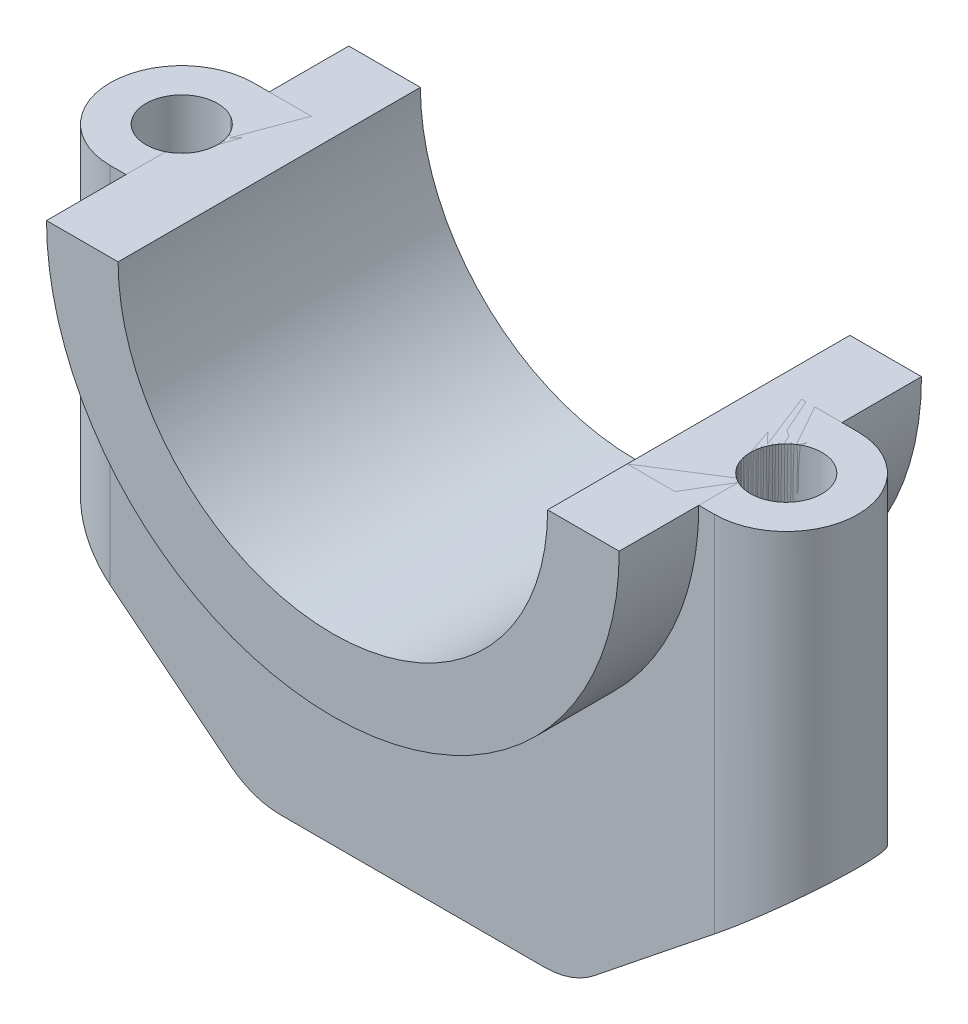
ISO-10303-21;
HEADER;
FILE_DESCRIPTION(('STEP AP214'),'2;1');
FILE_NAME('part.step','',(''),(''),'','','');
FILE_SCHEMA(('AUTOMOTIVE_DESIGN { 1 0 10303 214 1 1 1 1 }'));
ENDSEC;
DATA;
#1=APPLICATION_CONTEXT('core data for automotive mechanical design processes');
#2=APPLICATION_PROTOCOL_DEFINITION('international standard','automotive_design',2000,#1);
#3=PRODUCT_CONTEXT('',#1,'mechanical');
#4=PRODUCT('Part','Part','',(#3));
#5=PRODUCT_RELATED_PRODUCT_CATEGORY('part','',(#4));
#6=PRODUCT_DEFINITION_FORMATION('','',#4);
#7=PRODUCT_DEFINITION_CONTEXT('part definition',#1,'design');
#8=PRODUCT_DEFINITION('design','',#6,#7);
#9=PRODUCT_DEFINITION_SHAPE('','',#8);
#10=(LENGTH_UNIT() NAMED_UNIT(*) SI_UNIT(.MILLI.,.METRE.));
#11=(NAMED_UNIT(*) PLANE_ANGLE_UNIT() SI_UNIT($,.RADIAN.));
#12=(NAMED_UNIT(*) SI_UNIT($,.STERADIAN.) SOLID_ANGLE_UNIT());
#13=UNCERTAINTY_MEASURE_WITH_UNIT(LENGTH_MEASURE(1.E-05),#10,'distance_accuracy_value','');
#14=(GEOMETRIC_REPRESENTATION_CONTEXT(3) GLOBAL_UNCERTAINTY_ASSIGNED_CONTEXT((#13)) GLOBAL_UNIT_ASSIGNED_CONTEXT((#10,
#11,#12)) REPRESENTATION_CONTEXT('',''));
#15=CARTESIAN_POINT('',(0.,0.,0.));
#16=DIRECTION('',(0.,0.,1.));
#17=DIRECTION('',(1.,0.,0.));
#18=AXIS2_PLACEMENT_3D('',#15,#16,#17);
#19=CARTESIAN_POINT('',(0.,0.,19.));
#20=DIRECTION('',(0.,0.,-1.));
#21=DIRECTION('',(-1.,0.,0.));
#22=AXIS2_PLACEMENT_3D('',#19,#20,#21);
#23=CYLINDRICAL_SURFACE('',#22,27.);
#24=CARTESIAN_POINT('',(0.,0.,-19.));
#25=DIRECTION('',(0.,0.,1.));
#26=DIRECTION('',(1.,0.,0.));
#27=AXIS2_PLACEMENT_3D('',#24,#25,#26);
#28=CIRCLE('',#27,27.);
#29=CARTESIAN_POINT('',(-27.,0.,-19.));
#30=VERTEX_POINT('',#29);
#31=CARTESIAN_POINT('',(27.,0.,-19.));
#32=VERTEX_POINT('',#31);
#33=EDGE_CURVE('E132',#30,#32,#28,.T.);
#34=ORIENTED_EDGE('',*,*,#33,.F.);
#35=DIRECTION('',(0.,0.,-1.));
#36=VECTOR('',#35,1.);
#37=CARTESIAN_POINT('',(-27.,0.,19.));
#38=LINE('',#37,#36);
#39=CARTESIAN_POINT('',(-27.,0.,19.));
#40=VERTEX_POINT('',#39);
#41=EDGE_CURVE('E76',#40,#30,#38,.T.);
#42=ORIENTED_EDGE('',*,*,#41,.F.);
#43=CARTESIAN_POINT('',(0.,0.,19.));
#44=DIRECTION('',(0.,0.,1.));
#45=DIRECTION('',(1.,0.,0.));
#46=AXIS2_PLACEMENT_3D('',#43,#44,#45);
#47=CIRCLE('',#46,27.);
#48=CARTESIAN_POINT('',(27.,0.,19.));
#49=VERTEX_POINT('',#48);
#50=EDGE_CURVE('E169',#40,#49,#47,.T.);
#51=ORIENTED_EDGE('',*,*,#50,.T.);
#52=DIRECTION('',(0.,0.,-1.));
#53=VECTOR('',#52,1.);
#54=CARTESIAN_POINT('',(27.,0.,19.));
#55=LINE('',#54,#53);
#56=EDGE_CURVE('E141',#49,#32,#55,.T.);
#57=ORIENTED_EDGE('',*,*,#56,.T.);
#58=EDGE_LOOP('',(#34,#42,#51,#57));
#59=FACE_BOUND('',#58,.T.);
#60=ADVANCED_FACE('F63',(#59),#23,.F.);
#61=CARTESIAN_POINT('',(0.,0.,19.));
#62=DIRECTION('',(0.,1.,0.));
#63=DIRECTION('',(0.,0.,1.));
#64=AXIS2_PLACEMENT_3D('',#61,#62,#63);
#65=PLANE('',#64);
#66=CARTESIAN_POINT('',(-38.,0.,0.));
#67=DIRECTION('',(0.,1.,0.));
#68=DIRECTION('',(0.,0.,1.));
#69=AXIS2_PLACEMENT_3D('',#66,#67,#68);
#70=CIRCLE('',#69,4.5);
#71=CARTESIAN_POINT('',(-36.,0.,4.03112887414927));
#72=VERTEX_POINT('',#71);
#73=CARTESIAN_POINT('',(-36.,0.,-4.03112887414927));
#74=VERTEX_POINT('',#73);
#75=EDGE_CURVE('E82',#72,#74,#70,.T.);
#76=ORIENTED_EDGE('',*,*,#75,.F.);
#77=DIRECTION('',(0.,0.,-1.));
#78=VECTOR('',#77,1.);
#79=CARTESIAN_POINT('',(-36.,0.,19.));
#80=LINE('',#79,#78);
#81=CARTESIAN_POINT('',(-36.,0.,19.));
#82=VERTEX_POINT('',#81);
#83=EDGE_CURVE('E139',#82,#72,#80,.T.);
#84=ORIENTED_EDGE('',*,*,#83,.F.);
#85=DIRECTION('',(1.,0.,0.));
#86=VECTOR('',#85,1.);
#87=CARTESIAN_POINT('',(0.,0.,19.));
#88=LINE('',#87,#86);
#89=EDGE_CURVE('E153',#82,#40,#88,.T.);
#90=ORIENTED_EDGE('',*,*,#89,.T.);
#91=ORIENTED_EDGE('',*,*,#41,.T.);
#92=DIRECTION('',(1.,0.,0.));
#93=VECTOR('',#92,1.);
#94=CARTESIAN_POINT('',(0.,0.,-19.));
#95=LINE('',#94,#93);
#96=CARTESIAN_POINT('',(-36.,0.,-19.));
#97=VERTEX_POINT('',#96);
#98=EDGE_CURVE('E151',#97,#30,#95,.T.);
#99=ORIENTED_EDGE('',*,*,#98,.F.);
#100=EDGE_CURVE('E137',#74,#97,#80,.T.);
#101=ORIENTED_EDGE('',*,*,#100,.F.);
#102=EDGE_LOOP('',(#76,#84,#90,#91,#99,#101));
#103=FACE_BOUND('',#102,.T.);
#104=ADVANCED_FACE('F148',(#103),#65,.T.);
#105=CARTESIAN_POINT('',(0.,0.,19.));
#106=DIRECTION('',(0.,0.,-1.));
#107=DIRECTION('',(-1.,0.,0.));
#108=AXIS2_PLACEMENT_3D('',#105,#106,#107);
#109=CYLINDRICAL_SURFACE('',#108,36.);
#110=ORIENTED_EDGE('',*,*,#83,.T.);
#111=CARTESIAN_POINT('',(-36.,0.,4.03112887414927));
#112=CARTESIAN_POINT('',(-36.0000000557983,-0.188013709173996,4.03112573962688));
#113=CARTESIAN_POINT('',(-35.998527066807,-0.376023509734113,4.03039853185731));
#114=CARTESIAN_POINT('',(-35.9926362603933,-0.751984821952165,4.02746896092898));
#115=CARTESIAN_POINT('',(-35.9882184526503,-0.93993633379966,4.02526660261894));
#116=CARTESIAN_POINT('',(-35.9705481437723,-1.5036785455182,4.01640551216183));
#117=CARTESIAN_POINT('',(-35.9528787575284,-1.87930790342856,4.00749275117653));
#118=CARTESIAN_POINT('',(-35.9056476591523,-2.63203193682279,3.98301390237765));
#119=CARTESIAN_POINT('',(-35.8760099957818,-3.00912044203989,3.9674052821464));
#120=CARTESIAN_POINT('',(-35.8049155027943,-3.76176721539991,3.92851743028222));
#121=CARTESIAN_POINT('',(-35.7634595015463,-4.13732558892192,3.90523873624096));
#122=CARTESIAN_POINT('',(-35.6679059361072,-4.89373675772656,3.84895882859857));
#123=CARTESIAN_POINT('',(-35.6135736760105,-5.27454658530967,3.81577371891469));
#124=CARTESIAN_POINT('',(-35.4929565832223,-6.03303292997784,3.73763305664548));
#125=CARTESIAN_POINT('',(-35.4266728801929,-6.4107097396727,3.69267861632742));
#126=CARTESIAN_POINT('',(-35.2826909967385,-7.16079945510109,3.58806098750926));
#127=CARTESIAN_POINT('',(-35.2050250970399,-7.53322408537032,3.5284390827266));
#128=CARTESIAN_POINT('',(-35.0803706331879,-8.08724048037256,3.42471121552876));
#129=CARTESIAN_POINT('',(-35.0374690192193,-8.27110718345403,3.38776133975927));
#130=CARTESIAN_POINT('',(-34.9490674123995,-8.63701862367302,3.30837604763307));
#131=CARTESIAN_POINT('',(-34.9035676477873,-8.81906351920421,3.26594111270828));
#132=CARTESIAN_POINT('',(-34.8136918206357,-9.16715159673981,3.17821877032383));
#133=CARTESIAN_POINT('',(-34.7694942441547,-9.33335723718422,3.13339498966194));
#134=CARTESIAN_POINT('',(-34.6791924611841,-9.66348236581876,3.0375282894289));
#135=CARTESIAN_POINT('',(-34.6330879829362,-9.82740152367308,2.98648448139151));
#136=CARTESIAN_POINT('',(-34.5392106318234,-10.1524159017312,2.87717425667004));
#137=CARTESIAN_POINT('',(-34.491437160654,-10.3135100774919,2.81890523038839));
#138=CARTESIAN_POINT('',(-34.3945966109139,-10.6319990173295,2.69394199476521));
#139=CARTESIAN_POINT('',(-34.3455297868407,-10.789394497851,2.62724943330277));
#140=CARTESIAN_POINT('',(-34.2560013785844,-11.0699483318514,2.49748812024294));
#141=CARTESIAN_POINT('',(-34.215672934888,-11.1939378496402,2.4361315711842));
#142=CARTESIAN_POINT('',(-34.1349152257627,-11.4378340232424,2.30586152418296));
#143=CARTESIAN_POINT('',(-34.0944859940872,-11.5577418888226,2.23695029139713));
#144=CARTESIAN_POINT('',(-34.0142215539306,-11.7918610278121,2.0905782745039));
#145=CARTESIAN_POINT('',(-33.9743847815826,-11.9060904608359,2.0131476835008));
#146=CARTESIAN_POINT('',(-33.8960206502531,-12.1273875769248,1.84815937166182));
#147=CARTESIAN_POINT('',(-33.8574920366693,-12.2344622231023,1.76061173024656));
#148=CARTESIAN_POINT('',(-33.7858661174036,-12.4308204763775,1.58103453949844));
#149=CARTESIAN_POINT('',(-33.7525799157078,-12.520840920081,1.48989744849442));
#150=CARTESIAN_POINT('',(-33.689520557428,-12.6895355896852,1.29620299503959));
#151=CARTESIAN_POINT('',(-33.6597508888542,-12.7681985671441,1.19363448660173));
#152=CARTESIAN_POINT('',(-33.6053919383276,-12.9105973868877,0.974837963885846));
#153=CARTESIAN_POINT('',(-33.5808848899324,-12.9740978014423,0.858431936470456));
#154=CARTESIAN_POINT('',(-33.5404603906837,-13.0782534767936,0.614487478716559));
#155=CARTESIAN_POINT('',(-33.5245122572628,-13.1189903637506,0.486990744114766));
#156=CARTESIAN_POINT('',(-33.5068054835566,-13.1641320726042,0.264149086378415));
#157=CARTESIAN_POINT('',(-33.5022430620037,-13.1757245630217,0.170467144910296));
#158=CARTESIAN_POINT('',(-33.4990542647936,-13.1838307595428,-0.0176593753999057));
#159=CARTESIAN_POINT('',(-33.5004261295076,-13.1803489354675,-0.112103719885269));
#160=CARTESIAN_POINT('',(-33.5089570974596,-13.158644203925,-0.298761240777823));
#161=CARTESIAN_POINT('',(-33.5161036470163,-13.1404532727653,-0.390978810605043));
#162=CARTESIAN_POINT('',(-33.5354798718711,-13.0909238861703,-0.571228296467531));
#163=CARTESIAN_POINT('',(-33.5477132551728,-13.0595758398128,-0.65925710687025));
#164=CARTESIAN_POINT('',(-33.5824563114603,-12.9700342731434,-0.866351144504587));
#165=CARTESIAN_POINT('',(-33.6071231867094,-12.90609335159,-0.98255470282175));
#166=CARTESIAN_POINT('',(-33.6622085837359,-12.7617270292287,-1.20272163548294));
#167=CARTESIAN_POINT('',(-33.6926414671224,-12.681260424353,-1.306653371682));
#168=CARTESIAN_POINT('',(-33.7516657720454,-12.523216396795,-1.48627197760219));
#169=CARTESIAN_POINT('',(-33.7797014077731,-12.4474425737575,-1.56376562403687));
#170=CARTESIAN_POINT('',(-33.8374249238169,-12.2896596547854,-1.71150979509827));
#171=CARTESIAN_POINT('',(-33.8671139705217,-12.2076461417764,-1.78175510416659));
#172=CARTESIAN_POINT('',(-33.9275301535736,-12.0387191138661,-1.91582991347458));
#173=CARTESIAN_POINT('',(-33.9582587980577,-11.9517983461663,-1.97964950754375));
#174=CARTESIAN_POINT('',(-34.0202595639702,-11.7741587751848,-2.10150625088933));
#175=CARTESIAN_POINT('',(-34.0515318958687,-11.683438480995,-2.15954109950156));
#176=CARTESIAN_POINT('',(-34.1476831349331,-11.4007053542252,-2.32960776067819));
#177=CARTESIAN_POINT('',(-34.2128665666951,-11.203759487929,-2.43328671306787));
#178=CARTESIAN_POINT('',(-34.3420476509585,-10.801324855886,-2.62346101345312));
#179=CARTESIAN_POINT('',(-34.406043950547,-10.59582711653,-2.70993773155297));
#180=CARTESIAN_POINT('',(-34.5318506505607,-10.1783560983058,-2.86919009845059));
#181=CARTESIAN_POINT('',(-34.5936551895309,-9.9663679220593,-2.94193097253875));
#182=CARTESIAN_POINT('',(-34.7141798637052,-9.53809311165747,-3.07595307040701));
#183=CARTESIAN_POINT('',(-34.7729012303722,-9.32180824197945,-3.1372388949237));
#184=CARTESIAN_POINT('',(-34.8978759175449,-8.8436730071932,-3.26129088428467));
#185=CARTESIAN_POINT('',(-34.9633856808066,-8.58110976162614,-3.32204540581356));
#186=CARTESIAN_POINT('',(-35.088935455899,-8.05235961141288,-3.4325912347897));
#187=CARTESIAN_POINT('',(-35.1489740909923,-7.78617181395882,-3.48237978723712));
#188=CARTESIAN_POINT('',(-35.2633131643589,-7.2507761328024,-3.5729349668631));
#189=CARTESIAN_POINT('',(-35.3176078369017,-6.98156550901381,-3.61369257294048));
#190=CARTESIAN_POINT('',(-35.4201877875644,-6.44096294850382,-3.68762272726887));
#191=CARTESIAN_POINT('',(-35.4684727101274,-6.16957088373137,-3.72079482683313));
#192=CARTESIAN_POINT('',(-35.558922379363,-5.62488318762118,-3.78075170717563));
#193=CARTESIAN_POINT('',(-35.6010829517019,-5.35158638975997,-3.80753213933846));
#194=CARTESIAN_POINT('',(-35.6791510262961,-4.80362134037004,-3.85561399641244));
#195=CARTESIAN_POINT('',(-35.7150584004744,-4.52895306086937,-3.87691530910547));
#196=CARTESIAN_POINT('',(-35.7805324817709,-3.97871903159085,-3.91476605629906));
#197=CARTESIAN_POINT('',(-35.8101032859227,-3.70315397937703,-3.93131856359336));
#198=CARTESIAN_POINT('',(-35.862889330305,-3.15119715220291,-3.96025967531034));
#199=CARTESIAN_POINT('',(-35.8861043657098,-2.87480535088927,-3.97264814554256));
#200=CARTESIAN_POINT('',(-35.9374456316318,-2.16524881672561,-3.99964481314717));
#201=CARTESIAN_POINT('',(-35.9609504276453,-1.73163238059938,-4.01156049079648));
#202=CARTESIAN_POINT('',(-35.9844009415626,-1.08152611724865,-4.02335927382502));
#203=CARTESIAN_POINT('',(-35.9902500195788,-0.865278521847778,-4.02627992121258));
#204=CARTESIAN_POINT('',(-35.9980495703292,-0.432689949794082,-4.03016221036749));
#205=CARTESIAN_POINT('',(-35.999999945061,-0.216348970930584,-4.03112380288979));
#206=CARTESIAN_POINT('',(-36.,0.,-4.03112887414927));
#207=B_SPLINE_CURVE_WITH_KNOTS('',3,(#111,#112,#113,#114,#115,#116,#117,#118,#119,#120,#121,
#122,#123,#124,#125,#126,#127,#128,#129,#130,#131,#132,#133,#134,#135,#136,#137,#138,#139,#140,
#141,#142,#143,#144,#145,#146,#147,#148,#149,#150,#151,#152,#153,#154,#155,#156,#157,#158,#159,
#160,#161,#162,#163,#164,#165,#166,#167,#168,#169,#170,#171,#172,#173,#174,#175,#176,#177,#178,
#179,#180,#181,#182,#183,#184,#185,#186,#187,#188,#189,#190,#191,#192,#193,#194,#195,#196,#197,
#198,#199,#200,#201,#202,#203,#204,#205,#206),.UNSPECIFIED.,.F.,.F.,(4,2,2,2,2,2,2,2,2,2,2,2,2,
2,2,2,2,2,2,2,2,2,2,2,2,2,2,2,2,2,2,2,2,2,2,2,2,2,2,2,2,2,2,2,2,2,2,4),(0.,0.564026052510787,
1.1280502511096,2.25624562083412,3.3917159962576,4.5271068040498,5.68504497853642,
6.84287376089532,7.99748022099052,8.57455885997268,9.15158688224185,9.68465326477401,
10.2177958797481,10.7511316186465,11.2843631832909,11.7164497043608,12.1484070233893,
12.5788799803677,13.0089277040587,13.4051898369042,13.8018417747931,14.2043014950865,
14.6053086468198,14.8875329171065,15.1696735082594,15.4512023942618,15.7329368590739,
16.1353793484306,16.5388377167425,16.8742168606217,17.2098356687717,17.5459642047156,
17.8822258941274,18.5767755114326,19.272073274131,19.9691083739157,20.665862916351,
21.4975462624284,22.3294383160507,23.1621576456521,23.9949262183131,24.8282597659886,
25.6616103798505,26.4944205377859,27.3272575313327,28.6300782864645,29.27908180876,
29.9281016449502),.UNSPECIFIED.);
#208=EDGE_CURVE('E12',#72,#74,#207,.T.);
#209=ORIENTED_EDGE('',*,*,#208,.T.);
#210=ORIENTED_EDGE('',*,*,#100,.T.);
#211=CARTESIAN_POINT('',(0.,0.,-19.));
#212=DIRECTION('',(0.,0.,1.));
#213=DIRECTION('',(1.,0.,0.));
#214=AXIS2_PLACEMENT_3D('',#211,#212,#213);
#215=CIRCLE('',#214,36.);
#216=CARTESIAN_POINT('',(36.,0.,-19.));
#217=VERTEX_POINT('',#216);
#218=EDGE_CURVE('E164',#97,#217,#215,.T.);
#219=ORIENTED_EDGE('',*,*,#218,.T.);
#220=DIRECTION('',(0.,0.,-1.));
#221=VECTOR('',#220,1.);
#222=CARTESIAN_POINT('',(36.,0.,19.));
#223=LINE('',#222,#221);
#224=CARTESIAN_POINT('',(36.,0.,-4.03112887414927));
#225=VERTEX_POINT('',#224);
#226=EDGE_CURVE('E131',#225,#217,#223,.T.);
#227=ORIENTED_EDGE('',*,*,#226,.F.);
#228=CARTESIAN_POINT('',(36.,0.,-4.03112887414927));
#229=CARTESIAN_POINT('',(36.0000000557983,-0.188013709173991,-4.03112573962688));
#230=CARTESIAN_POINT('',(35.998527066807,-0.376023509734108,-4.03039853185731));
#231=CARTESIAN_POINT('',(35.9926362603933,-0.751984821952161,-4.02746896092898));
#232=CARTESIAN_POINT('',(35.9882184526503,-0.939936333799656,-4.02526660261894));
#233=CARTESIAN_POINT('',(35.9705481437723,-1.5036785455182,-4.01640551216183));
#234=CARTESIAN_POINT('',(35.9528787575284,-1.87930790342856,-4.00749275117653));
#235=CARTESIAN_POINT('',(35.9056476591523,-2.63203193682279,-3.98301390237765));
#236=CARTESIAN_POINT('',(35.8760099957818,-3.00912044203989,-3.9674052821464));
#237=CARTESIAN_POINT('',(35.8049155027943,-3.76176721539991,-3.92851743028222));
#238=CARTESIAN_POINT('',(35.7634595015463,-4.13732558892192,-3.90523873624095));
#239=CARTESIAN_POINT('',(35.6679059361072,-4.89373675772656,-3.84895882859857));
#240=CARTESIAN_POINT('',(35.6135736760105,-5.27454658530966,-3.8157737189147));
#241=CARTESIAN_POINT('',(35.4929565832223,-6.03303292997784,-3.73763305664548));
#242=CARTESIAN_POINT('',(35.4266728801929,-6.41070973967269,-3.69267861632742));
#243=CARTESIAN_POINT('',(35.2826909967385,-7.16079945510109,-3.58806098750925));
#244=CARTESIAN_POINT('',(35.2050250970399,-7.53322408537031,-3.5284390827266));
#245=CARTESIAN_POINT('',(35.0803706331879,-8.08724048037255,-3.42471121552876));
#246=CARTESIAN_POINT('',(35.0374690192193,-8.27110718345403,-3.38776133975927));
#247=CARTESIAN_POINT('',(34.9490674123995,-8.63701862367301,-3.30837604763307));
#248=CARTESIAN_POINT('',(34.9035676477873,-8.8190635192042,-3.26594111270828));
#249=CARTESIAN_POINT('',(34.8136918206357,-9.16715159673981,-3.17821877032383));
#250=CARTESIAN_POINT('',(34.7694942441547,-9.33335723718421,-3.13339498966193));
#251=CARTESIAN_POINT('',(34.6791924611841,-9.66348236581875,-3.0375282894289));
#252=CARTESIAN_POINT('',(34.6330879829362,-9.82740152367309,-2.98648448139151));
#253=CARTESIAN_POINT('',(34.5392106318234,-10.1524159017312,-2.87717425667004));
#254=CARTESIAN_POINT('',(34.491437160654,-10.3135100774919,-2.81890523038838));
#255=CARTESIAN_POINT('',(34.3945966109139,-10.6319990173295,-2.69394199476519));
#256=CARTESIAN_POINT('',(34.3455297868407,-10.789394497851,-2.62724943330276));
#257=CARTESIAN_POINT('',(34.2560013785844,-11.0699483318514,-2.49748812024294));
#258=CARTESIAN_POINT('',(34.215672934888,-11.1939378496402,-2.43613157118418));
#259=CARTESIAN_POINT('',(34.1349152257627,-11.4378340232424,-2.30586152418295));
#260=CARTESIAN_POINT('',(34.0944859940872,-11.5577418888226,-2.23695029139713));
#261=CARTESIAN_POINT('',(34.0142215539307,-11.7918610278121,-2.09057827450391));
#262=CARTESIAN_POINT('',(33.9743847815826,-11.9060904608359,-2.01314768350081));
#263=CARTESIAN_POINT('',(33.8960206502531,-12.1273875769248,-1.84815937166183));
#264=CARTESIAN_POINT('',(33.8574920366693,-12.2344622231023,-1.76061173024657));
#265=CARTESIAN_POINT('',(33.7858661174036,-12.4308204763774,-1.58103453949845));
#266=CARTESIAN_POINT('',(33.7525799157078,-12.520840920081,-1.48989744849444));
#267=CARTESIAN_POINT('',(33.689520557428,-12.6895355896852,-1.2962029950396));
#268=CARTESIAN_POINT('',(33.6597508888542,-12.7681985671441,-1.19363448660173));
#269=CARTESIAN_POINT('',(33.6053919383276,-12.9105973868877,-0.974837963885843));
#270=CARTESIAN_POINT('',(33.5808848899324,-12.9740978014423,-0.858431936470453));
#271=CARTESIAN_POINT('',(33.5404603906837,-13.0782534767936,-0.61448747871655));
#272=CARTESIAN_POINT('',(33.5245122572628,-13.1189903637506,-0.486990744114752));
#273=CARTESIAN_POINT('',(33.5068054835566,-13.1641320726042,-0.264149086378396));
#274=CARTESIAN_POINT('',(33.5022430620037,-13.1757245630217,-0.170467144910278));
#275=CARTESIAN_POINT('',(33.4990542647936,-13.1838307595428,0.0176593753999224));
#276=CARTESIAN_POINT('',(33.5004261295076,-13.1803489354675,0.112103719885284));
#277=CARTESIAN_POINT('',(33.5089570974596,-13.158644203925,0.298761240777837));
#278=CARTESIAN_POINT('',(33.5161036470163,-13.1404532727654,0.390978810605056));
#279=CARTESIAN_POINT('',(33.5354798718711,-13.0909238861703,0.571228296467544));
#280=CARTESIAN_POINT('',(33.5477132551728,-13.0595758398128,0.659257106870264));
#281=CARTESIAN_POINT('',(33.5824563114603,-12.9700342731434,0.8663511445046));
#282=CARTESIAN_POINT('',(33.6071231867094,-12.90609335159,0.982554702821761));
#283=CARTESIAN_POINT('',(33.6622085837359,-12.7617270292287,1.20272163548295));
#284=CARTESIAN_POINT('',(33.6926414671224,-12.681260424353,1.30665337168201));
#285=CARTESIAN_POINT('',(33.7516657720454,-12.523216396795,1.48627197760221));
#286=CARTESIAN_POINT('',(33.7797014077732,-12.4474425737574,1.56376562403689));
#287=CARTESIAN_POINT('',(33.8374249238169,-12.2896596547854,1.7115097950983));
#288=CARTESIAN_POINT('',(33.8671139705217,-12.2076461417763,1.78175510416661));
#289=CARTESIAN_POINT('',(33.9275301535736,-12.0387191138661,1.91582991347461));
#290=CARTESIAN_POINT('',(33.9582587980577,-11.9517983461662,1.97964950754377));
#291=CARTESIAN_POINT('',(34.0202595639702,-11.7741587751848,2.10150625088935));
#292=CARTESIAN_POINT('',(34.0515318958687,-11.6834384809949,2.15954109950158));
#293=CARTESIAN_POINT('',(34.1476831349331,-11.4007053542251,2.32960776067821));
#294=CARTESIAN_POINT('',(34.2128665666951,-11.203759487929,2.4332867130679));
#295=CARTESIAN_POINT('',(34.3420476509585,-10.8013248558859,2.62346101345315));
#296=CARTESIAN_POINT('',(34.4060439505471,-10.5958271165299,2.709937731553));
#297=CARTESIAN_POINT('',(34.5318506505607,-10.1783560983057,2.86919009845061));
#298=CARTESIAN_POINT('',(34.593655189531,-9.96636792205922,2.94193097253877));
#299=CARTESIAN_POINT('',(34.7141798637052,-9.53809311165738,3.07595307040704));
#300=CARTESIAN_POINT('',(34.7729012303722,-9.32180824197936,3.13723889492372));
#301=CARTESIAN_POINT('',(34.8978759175449,-8.8436730071931,3.26129088428469));
#302=CARTESIAN_POINT('',(34.9633856808066,-8.58110976162604,3.32204540581358));
#303=CARTESIAN_POINT('',(35.088935455899,-8.05235961141276,3.43259123478972));
#304=CARTESIAN_POINT('',(35.1489740909923,-7.78617181395869,3.48237978723714));
#305=CARTESIAN_POINT('',(35.2633131643589,-7.25077613280226,3.57293496686312));
#306=CARTESIAN_POINT('',(35.3176078369018,-6.98156550901367,3.6136925729405));
#307=CARTESIAN_POINT('',(35.4201877875644,-6.44096294850367,3.68762272726889));
#308=CARTESIAN_POINT('',(35.4684727101274,-6.16957088373122,3.72079482683315));
#309=CARTESIAN_POINT('',(35.558922379363,-5.62488318762101,3.78075170717565));
#310=CARTESIAN_POINT('',(35.6010829517019,-5.35158638975979,3.80753213933848));
#311=CARTESIAN_POINT('',(35.6791510262961,-4.80362134036985,3.85561399641245));
#312=CARTESIAN_POINT('',(35.7150584004744,-4.52895306086918,3.87691530910548));
#313=CARTESIAN_POINT('',(35.780532481771,-3.97871903159065,3.91476605629908));
#314=CARTESIAN_POINT('',(35.8101032859227,-3.70315397937682,3.93131856359337));
#315=CARTESIAN_POINT('',(35.862889330305,-3.15119715220269,3.96025967531035));
#316=CARTESIAN_POINT('',(35.8861043657098,-2.87480535088904,3.97264814554257));
#317=CARTESIAN_POINT('',(35.9374456316318,-2.16524881672541,3.99964481314718));
#318=CARTESIAN_POINT('',(35.9609504276453,-1.73163238059922,4.01156049079648));
#319=CARTESIAN_POINT('',(35.9844009415626,-1.08152611724855,4.02335927382502));
#320=CARTESIAN_POINT('',(35.9902500195788,-0.865278521847701,4.02627992121258));
#321=CARTESIAN_POINT('',(35.9980495703292,-0.432689949794043,4.03016221036749));
#322=CARTESIAN_POINT('',(35.999999945061,-0.216348970930565,4.03112380288979));
#323=CARTESIAN_POINT('',(36.,0.,4.03112887414927));
#324=B_SPLINE_CURVE_WITH_KNOTS('',3,(#228,#229,#230,#231,#232,#233,#234,#235,#236,#237,#238,
#239,#240,#241,#242,#243,#244,#245,#246,#247,#248,#249,#250,#251,#252,#253,#254,#255,#256,#257,
#258,#259,#260,#261,#262,#263,#264,#265,#266,#267,#268,#269,#270,#271,#272,#273,#274,#275,#276,
#277,#278,#279,#280,#281,#282,#283,#284,#285,#286,#287,#288,#289,#290,#291,#292,#293,#294,#295,
#296,#297,#298,#299,#300,#301,#302,#303,#304,#305,#306,#307,#308,#309,#310,#311,#312,#313,#314,
#315,#316,#317,#318,#319,#320,#321,#322,#323),.UNSPECIFIED.,.F.,.F.,(4,2,2,2,2,2,2,2,2,2,2,2,2,
2,2,2,2,2,2,2,2,2,2,2,2,2,2,2,2,2,2,2,2,2,2,2,2,2,2,2,2,2,2,2,2,2,2,4),(0.,0.564026052510787,
1.1280502511096,2.25624562083413,3.39171599625761,4.5271068040498,5.68504497853642,
6.84287376089532,7.99748022099052,8.57455885997268,9.15158688224185,9.68465326477401,
10.2177958797481,10.7511316186466,11.2843631832909,11.7164497043608,12.1484070233893,
12.5788799803677,13.0089277040586,13.4051898369042,13.8018417747931,14.2043014950865,
14.6053086468198,14.8875329171065,15.1696735082594,15.4512023942619,15.7329368590739,
16.1353793484306,16.5388377167425,16.8742168606217,17.2098356687717,17.5459642047156,
17.8822258941275,18.5767755114326,19.2720732741311,19.9691083739158,20.6658629163511,
21.4975462624285,22.3294383160509,23.1621576456523,23.9949262183132,24.8282597659888,
25.6616103798507,26.4944205377861,27.3272575313329,28.6300782864647,29.27908180876,
29.9281016449502),.UNSPECIFIED.);
#325=CARTESIAN_POINT('',(36.,0.,4.03112887414927));
#326=VERTEX_POINT('',#325);
#327=EDGE_CURVE('E88',#225,#326,#324,.T.);
#328=ORIENTED_EDGE('',*,*,#327,.T.);
#329=CARTESIAN_POINT('',(36.,0.,19.));
#330=VERTEX_POINT('',#329);
#331=EDGE_CURVE('E128',#330,#326,#223,.T.);
#332=ORIENTED_EDGE('',*,*,#331,.F.);
#333=CARTESIAN_POINT('',(0.,0.,19.));
#334=DIRECTION('',(0.,0.,1.));
#335=DIRECTION('',(1.,0.,0.));
#336=AXIS2_PLACEMENT_3D('',#333,#334,#335);
#337=CIRCLE('',#336,36.);
#338=EDGE_CURVE('E171',#82,#330,#337,.T.);
#339=ORIENTED_EDGE('',*,*,#338,.F.);
#340=EDGE_LOOP('',(#110,#209,#210,#219,#227,#328,#332,#339));
#341=FACE_BOUND('',#340,.T.);
#342=ADVANCED_FACE('F126',(#341),#109,.T.);
#343=CARTESIAN_POINT('',(0.,0.,19.));
#344=DIRECTION('',(0.,1.,0.));
#345=DIRECTION('',(0.,0.,1.));
#346=AXIS2_PLACEMENT_3D('',#343,#344,#345);
#347=PLANE('',#346);
#348=CARTESIAN_POINT('',(38.,0.,0.));
#349=DIRECTION('',(0.,1.,0.));
#350=DIRECTION('',(0.,0.,1.));
#351=AXIS2_PLACEMENT_3D('',#348,#349,#350);
#352=CIRCLE('',#351,4.5);
#353=EDGE_CURVE('E117',#225,#326,#352,.T.);
#354=ORIENTED_EDGE('',*,*,#353,.F.);
#355=ORIENTED_EDGE('',*,*,#226,.T.);
#356=DIRECTION('',(1.,0.,0.));
#357=VECTOR('',#356,1.);
#358=CARTESIAN_POINT('',(0.,0.,-19.));
#359=LINE('',#358,#357);
#360=EDGE_CURVE('E166',#32,#217,#359,.T.);
#361=ORIENTED_EDGE('',*,*,#360,.F.);
#362=ORIENTED_EDGE('',*,*,#56,.F.);
#363=DIRECTION('',(1.,0.,0.));
#364=VECTOR('',#363,1.);
#365=CARTESIAN_POINT('',(0.,0.,19.));
#366=LINE('',#365,#364);
#367=EDGE_CURVE('E136',#49,#330,#366,.T.);
#368=ORIENTED_EDGE('',*,*,#367,.T.);
#369=ORIENTED_EDGE('',*,*,#331,.T.);
#370=EDGE_LOOP('',(#354,#355,#361,#362,#368,#369));
#371=FACE_BOUND('',#370,.T.);
#372=ADVANCED_FACE('F134',(#371),#347,.T.);
#373=CARTESIAN_POINT('',(0.,0.,19.));
#374=DIRECTION('',(0.,0.,1.));
#375=DIRECTION('',(1.,0.,0.));
#376=AXIS2_PLACEMENT_3D('',#373,#374,#375);
#377=PLANE('',#376);
#378=ORIENTED_EDGE('',*,*,#50,.F.);
#379=ORIENTED_EDGE('',*,*,#89,.F.);
#380=ORIENTED_EDGE('',*,*,#338,.T.);
#381=ORIENTED_EDGE('',*,*,#367,.F.);
#382=EDGE_LOOP('',(#378,#379,#380,#381));
#383=FACE_BOUND('',#382,.T.);
#384=ADVANCED_FACE('F180',(#383),#377,.T.);
#385=CARTESIAN_POINT('',(0.,0.,-19.));
#386=DIRECTION('',(0.,0.,1.));
#387=DIRECTION('',(1.,0.,0.));
#388=AXIS2_PLACEMENT_3D('',#385,#386,#387);
#389=PLANE('',#388);
#390=ORIENTED_EDGE('',*,*,#33,.T.);
#391=ORIENTED_EDGE('',*,*,#360,.T.);
#392=ORIENTED_EDGE('',*,*,#218,.F.);
#393=ORIENTED_EDGE('',*,*,#98,.T.);
#394=EDGE_LOOP('',(#390,#391,#392,#393));
#395=FACE_BOUND('',#394,.T.);
#396=ADVANCED_FACE('F163',(#395),#389,.F.);
#397=CARTESIAN_POINT('',(38.,-60.,0.));
#398=DIRECTION('',(0.,1.,0.));
#399=DIRECTION('',(0.,0.,1.));
#400=AXIS2_PLACEMENT_3D('',#397,#398,#399);
#401=CYLINDRICAL_SURFACE('',#400,4.5);
#402=ORIENTED_EDGE('',*,*,#353,.T.);
#403=ORIENTED_EDGE('',*,*,#327,.F.);
#404=EDGE_LOOP('',(#402,#403));
#405=FACE_BOUND('',#404,.T.);
#406=ADVANCED_FACE('F118',(#405),#401,.F.);
#407=CARTESIAN_POINT('',(-38.,-60.,0.));
#408=DIRECTION('',(0.,1.,0.));
#409=DIRECTION('',(0.,0.,1.));
#410=AXIS2_PLACEMENT_3D('',#407,#408,#409);
#411=CYLINDRICAL_SURFACE('',#410,4.5);
#412=ORIENTED_EDGE('',*,*,#75,.T.);
#413=ORIENTED_EDGE('',*,*,#208,.F.);
#414=EDGE_LOOP('',(#412,#413));
#415=FACE_BOUND('',#414,.T.);
#416=ADVANCED_FACE('F182',(#415),#411,.F.);
#417=CLOSED_SHELL('',(#60,#104,#342,#372,#384,#396,#406,#416));
#418=MANIFOLD_SOLID_BREP('B2',#417);
#419=CARTESIAN_POINT('',(0.,0.,9.));
#420=DIRECTION('',(0.,1.,0.));
#421=DIRECTION('',(0.,0.,1.));
#422=AXIS2_PLACEMENT_3D('',#419,#420,#421);
#423=PLANE('',#422);
#424=CARTESIAN_POINT('',(38.,0.,0.));
#425=DIRECTION('',(0.,1.,0.));
#426=DIRECTION('',(0.,0.,1.));
#427=AXIS2_PLACEMENT_3D('',#424,#425,#426);
#428=CIRCLE('',#427,4.5);
#429=CARTESIAN_POINT('',(38.,0.,4.5));
#430=VERTEX_POINT('',#429);
#431=EDGE_CURVE('E456',#430,#430,#428,.T.);
#432=ORIENTED_EDGE('',*,*,#431,.F.);
#433=EDGE_LOOP('',(#432));
#434=FACE_BOUND('',#433,.T.);
#435=DIRECTION('',(1.,0.,0.));
#436=VECTOR('',#435,1.);
#437=CARTESIAN_POINT('',(0.,0.,9.));
#438=LINE('',#437,#436);
#439=CARTESIAN_POINT('',(27.,0.,9.));
#440=VERTEX_POINT('',#439);
#441=CARTESIAN_POINT('',(38.,0.,9.));
#442=VERTEX_POINT('',#441);
#443=EDGE_CURVE('E364',#440,#442,#438,.T.);
#444=ORIENTED_EDGE('',*,*,#443,.T.);
#445=CARTESIAN_POINT('',(38.,0.,0.));
#446=DIRECTION('',(0.,1.,0.));
#447=DIRECTION('',(0.,0.,1.));
#448=AXIS2_PLACEMENT_3D('',#445,#446,#447);
#449=CIRCLE('',#448,9.);
#450=CARTESIAN_POINT('',(38.,0.,-9.));
#451=VERTEX_POINT('',#450);
#452=EDGE_CURVE('E350',#442,#451,#449,.T.);
#453=ORIENTED_EDGE('',*,*,#452,.T.);
#454=DIRECTION('',(1.,0.,0.));
#455=VECTOR('',#454,1.);
#456=CARTESIAN_POINT('',(0.,0.,-9.));
#457=LINE('',#456,#455);
#458=CARTESIAN_POINT('',(27.,0.,-9.));
#459=VERTEX_POINT('',#458);
#460=EDGE_CURVE('E374',#459,#451,#457,.T.);
#461=ORIENTED_EDGE('',*,*,#460,.F.);
#462=DIRECTION('',(0.,0.,-1.));
#463=VECTOR('',#462,1.);
#464=CARTESIAN_POINT('',(27.,0.,9.));
#465=LINE('',#464,#463);
#466=EDGE_CURVE('E396',#440,#459,#465,.T.);
#467=ORIENTED_EDGE('',*,*,#466,.F.);
#468=EDGE_LOOP('',(#444,#453,#461,#467));
#469=FACE_BOUND('',#468,.T.);
#470=ADVANCED_FACE('F249',(#434,#469),#423,.T.);
#471=CARTESIAN_POINT('',(0.,0.,9.));
#472=DIRECTION('',(0.,1.,0.));
#473=DIRECTION('',(0.,0.,1.));
#474=AXIS2_PLACEMENT_3D('',#471,#472,#473);
#475=PLANE('',#474);
#476=CARTESIAN_POINT('',(-38.,0.,0.));
#477=DIRECTION('',(0.,1.,0.));
#478=DIRECTION('',(0.,0.,1.));
#479=AXIS2_PLACEMENT_3D('',#476,#477,#478);
#480=CIRCLE('',#479,4.5);
#481=CARTESIAN_POINT('',(-38.,0.,4.5));
#482=VERTEX_POINT('',#481);
#483=EDGE_CURVE('E404',#482,#482,#480,.T.);
#484=ORIENTED_EDGE('',*,*,#483,.F.);
#485=EDGE_LOOP('',(#484));
#486=FACE_BOUND('',#485,.T.);
#487=DIRECTION('',(1.,0.,0.));
#488=VECTOR('',#487,1.);
#489=CARTESIAN_POINT('',(0.,0.,-9.));
#490=LINE('',#489,#488);
#491=CARTESIAN_POINT('',(-38.,0.,-9.));
#492=VERTEX_POINT('',#491);
#493=CARTESIAN_POINT('',(-27.,0.,-9.));
#494=VERTEX_POINT('',#493);
#495=EDGE_CURVE('E347',#492,#494,#490,.T.);
#496=ORIENTED_EDGE('',*,*,#495,.F.);
#497=CARTESIAN_POINT('',(-38.,0.,0.));
#498=DIRECTION('',(0.,1.,0.));
#499=DIRECTION('',(0.,0.,1.));
#500=AXIS2_PLACEMENT_3D('',#497,#498,#499);
#501=CIRCLE('',#500,9.);
#502=CARTESIAN_POINT('',(-38.,0.,9.));
#503=VERTEX_POINT('',#502);
#504=EDGE_CURVE('E332',#492,#503,#501,.T.);
#505=ORIENTED_EDGE('',*,*,#504,.T.);
#506=DIRECTION('',(1.,0.,0.));
#507=VECTOR('',#506,1.);
#508=CARTESIAN_POINT('',(0.,0.,9.));
#509=LINE('',#508,#507);
#510=CARTESIAN_POINT('',(-27.,0.,9.));
#511=VERTEX_POINT('',#510);
#512=EDGE_CURVE('E345',#503,#511,#509,.T.);
#513=ORIENTED_EDGE('',*,*,#512,.T.);
#514=DIRECTION('',(0.,0.,-1.));
#515=VECTOR('',#514,1.);
#516=CARTESIAN_POINT('',(-27.,0.,9.));
#517=LINE('',#516,#515);
#518=EDGE_CURVE('E373',#511,#494,#517,.T.);
#519=ORIENTED_EDGE('',*,*,#518,.T.);
#520=EDGE_LOOP('',(#496,#505,#513,#519));
#521=FACE_BOUND('',#520,.T.);
#522=ADVANCED_FACE('F343',(#486,#521),#475,.T.);
#523=CARTESIAN_POINT('',(-37.1091423918723,-46.3864279898404,9.));
#524=DIRECTION('',(0.624695047554424,0.78086880944303,0.));
#525=DIRECTION('',(-0.78086880944303,0.624695047554424,0.));
#526=AXIS2_PLACEMENT_3D('',#523,#524,#525);
#527=PLANE('',#526);
#528=CARTESIAN_POINT('',(-38.,-45.6737419033383,0.));
#529=DIRECTION('',(0.624695047554424,0.78086880944303,0.));
#530=DIRECTION('',(-0.78086880944303,0.624695047554424,0.));
#531=AXIS2_PLACEMENT_3D('',#528,#529,#530);
#532=ELLIPSE('',#531,5.76281181368956,4.5);
#533=CARTESIAN_POINT('',(-42.5,-42.0737419033383,0.));
#534=VERTEX_POINT('',#533);
#535=EDGE_CURVE('E379',#534,#534,#532,.T.);
#536=ORIENTED_EDGE('',*,*,#535,.T.);
#537=EDGE_LOOP('',(#536));
#538=FACE_BOUND('',#537,.T.);
#539=DIRECTION('',(0.78086880944303,-0.624695047554424,0.));
#540=VECTOR('',#539,1.);
#541=CARTESIAN_POINT('',(-37.1091423918723,-46.3864279898404,-9.));
#542=LINE('',#541,#540);
#543=CARTESIAN_POINT('',(-38.,-45.6737419033383,-9.));
#544=VERTEX_POINT('',#543);
#545=CARTESIAN_POINT('',(-22.831317261135,-57.8086880944303,-9.));
#546=VERTEX_POINT('',#545);
#547=EDGE_CURVE('E385',#544,#546,#542,.T.);
#548=ORIENTED_EDGE('',*,*,#547,.T.);
#549=DIRECTION('',(0.,0.,-1.));
#550=VECTOR('',#549,1.);
#551=CARTESIAN_POINT('',(-22.831317261135,-57.8086880944303,9.));
#552=LINE('',#551,#550);
#553=CARTESIAN_POINT('',(-22.831317261135,-57.8086880944303,9.));
#554=VERTEX_POINT('',#553);
#555=EDGE_CURVE('E61',#546,#554,#552,.F.);
#556=ORIENTED_EDGE('',*,*,#555,.T.);
#557=DIRECTION('',(0.78086880944303,-0.624695047554424,0.));
#558=VECTOR('',#557,1.);
#559=CARTESIAN_POINT('',(-37.1091423918723,-46.3864279898404,9.));
#560=LINE('',#559,#558);
#561=CARTESIAN_POINT('',(-38.,-45.6737419033383,9.));
#562=VERTEX_POINT('',#561);
#563=EDGE_CURVE('E358',#562,#554,#560,.T.);
#564=ORIENTED_EDGE('',*,*,#563,.F.);
#565=CARTESIAN_POINT('',(-38.,-45.6737419033383,0.));
#566=DIRECTION('',(0.624695047554424,0.78086880944303,0.));
#567=DIRECTION('',(-0.78086880944303,0.624695047554424,0.));
#568=AXIS2_PLACEMENT_3D('',#565,#566,#567);
#569=ELLIPSE('',#568,11.5256236273791,9.);
#570=EDGE_CURVE('E334',#544,#562,#569,.T.);
#571=ORIENTED_EDGE('',*,*,#570,.F.);
#572=EDGE_LOOP('',(#548,#556,#564,#571));
#573=FACE_BOUND('',#572,.T.);
#574=ADVANCED_FACE('F454',(#538,#573),#527,.F.);
#575=CARTESIAN_POINT('',(37.1091423918724,-46.3864279898404,9.));
#576=DIRECTION('',(-0.624695047554425,0.78086880944303,0.));
#577=DIRECTION('',(-0.78086880944303,-0.624695047554425,0.));
#578=AXIS2_PLACEMENT_3D('',#575,#576,#577);
#579=PLANE('',#578);
#580=CARTESIAN_POINT('',(38.,-45.6737419033383,0.));
#581=DIRECTION('',(-0.624695047554425,0.78086880944303,0.));
#582=DIRECTION('',(0.78086880944303,0.624695047554425,0.));
#583=AXIS2_PLACEMENT_3D('',#580,#581,#582);
#584=ELLIPSE('',#583,5.76281181368956,4.5);
#585=CARTESIAN_POINT('',(42.5,-42.0737419033383,0.));
#586=VERTEX_POINT('',#585);
#587=EDGE_CURVE('E400',#586,#586,#584,.T.);
#588=ORIENTED_EDGE('',*,*,#587,.T.);
#589=EDGE_LOOP('',(#588));
#590=FACE_BOUND('',#589,.T.);
#591=DIRECTION('',(0.78086880944303,0.624695047554425,0.));
#592=VECTOR('',#591,1.);
#593=CARTESIAN_POINT('',(37.1091423918724,-46.3864279898404,9.));
#594=LINE('',#593,#592);
#595=CARTESIAN_POINT('',(22.831317261135,-57.8086880944303,9.));
#596=VERTEX_POINT('',#595);
#597=CARTESIAN_POINT('',(38.,-45.6737419033383,9.));
#598=VERTEX_POINT('',#597);
#599=EDGE_CURVE('E370',#596,#598,#594,.T.);
#600=ORIENTED_EDGE('',*,*,#599,.F.);
#601=DIRECTION('',(0.,0.,-1.));
#602=VECTOR('',#601,1.);
#603=CARTESIAN_POINT('',(22.831317261135,-57.8086880944303,9.));
#604=LINE('',#603,#602);
#605=CARTESIAN_POINT('',(22.831317261135,-57.8086880944303,-9.));
#606=VERTEX_POINT('',#605);
#607=EDGE_CURVE('E415',#596,#606,#604,.T.);
#608=ORIENTED_EDGE('',*,*,#607,.T.);
#609=DIRECTION('',(0.78086880944303,0.624695047554425,0.));
#610=VECTOR('',#609,1.);
#611=CARTESIAN_POINT('',(37.1091423918724,-46.3864279898404,-9.));
#612=LINE('',#611,#610);
#613=CARTESIAN_POINT('',(38.,-45.6737419033383,-9.));
#614=VERTEX_POINT('',#613);
#615=EDGE_CURVE('E391',#606,#614,#612,.T.);
#616=ORIENTED_EDGE('',*,*,#615,.T.);
#617=CARTESIAN_POINT('',(38.,-45.6737419033383,0.));
#618=DIRECTION('',(-0.624695047554425,0.78086880944303,0.));
#619=DIRECTION('',(0.78086880944303,0.624695047554425,0.));
#620=AXIS2_PLACEMENT_3D('',#617,#618,#619);
#621=ELLIPSE('',#620,11.5256236273791,9.);
#622=EDGE_CURVE('E349',#598,#614,#621,.T.);
#623=ORIENTED_EDGE('',*,*,#622,.F.);
#624=EDGE_LOOP('',(#600,#608,#616,#623));
#625=FACE_BOUND('',#624,.T.);
#626=ADVANCED_FACE('F440',(#590,#625),#579,.F.);
#627=CARTESIAN_POINT('',(0.,0.,9.));
#628=DIRECTION('',(0.,0.,1.));
#629=DIRECTION('',(1.,0.,0.));
#630=AXIS2_PLACEMENT_3D('',#627,#628,#629);
#631=PLANE('',#630);
#632=DIRECTION('',(1.,0.,0.));
#633=VECTOR('',#632,1.);
#634=CARTESIAN_POINT('',(0.,-60.,9.));
#635=LINE('',#634,#633);
#636=CARTESIAN_POINT('',(-16.5843667855908,-60.,9.));
#637=VERTEX_POINT('',#636);
#638=CARTESIAN_POINT('',(16.5843667855908,-60.,9.));
#639=VERTEX_POINT('',#638);
#640=EDGE_CURVE('E362',#637,#639,#635,.T.);
#641=ORIENTED_EDGE('',*,*,#640,.T.);
#642=CARTESIAN_POINT('',(16.5843667855908,-50.,9.));
#643=DIRECTION('',(0.,0.,1.));
#644=DIRECTION('',(1.,0.,0.));
#645=AXIS2_PLACEMENT_3D('',#642,#643,#644);
#646=CIRCLE('',#645,10.);
#647=EDGE_CURVE('E258',#639,#596,#646,.T.);
#648=ORIENTED_EDGE('',*,*,#647,.T.);
#649=ORIENTED_EDGE('',*,*,#599,.T.);
#650=DIRECTION('',(0.,1.,0.));
#651=VECTOR('',#650,1.);
#652=CARTESIAN_POINT('',(38.,-60.,9.));
#653=LINE('',#652,#651);
#654=EDGE_CURVE('E338',#598,#442,#653,.T.);
#655=ORIENTED_EDGE('',*,*,#654,.T.);
#656=ORIENTED_EDGE('',*,*,#443,.F.);
#657=CARTESIAN_POINT('',(0.,0.,9.));
#658=DIRECTION('',(0.,0.,1.));
#659=DIRECTION('',(1.,0.,0.));
#660=AXIS2_PLACEMENT_3D('',#657,#658,#659);
#661=CIRCLE('',#660,27.);
#662=EDGE_CURVE('E356',#511,#440,#661,.T.);
#663=ORIENTED_EDGE('',*,*,#662,.F.);
#664=ORIENTED_EDGE('',*,*,#512,.F.);
#665=DIRECTION('',(0.,1.,0.));
#666=VECTOR('',#665,1.);
#667=CARTESIAN_POINT('',(-38.,-60.,9.));
#668=LINE('',#667,#666);
#669=EDGE_CURVE('E328',#562,#503,#668,.T.);
#670=ORIENTED_EDGE('',*,*,#669,.F.);
#671=ORIENTED_EDGE('',*,*,#563,.T.);
#672=CARTESIAN_POINT('',(-16.5843667855908,-50.,9.));
#673=DIRECTION('',(0.,0.,1.));
#674=DIRECTION('',(1.,0.,0.));
#675=AXIS2_PLACEMENT_3D('',#672,#673,#674);
#676=CIRCLE('',#675,10.);
#677=EDGE_CURVE('E431',#554,#637,#676,.T.);
#678=ORIENTED_EDGE('',*,*,#677,.T.);
#679=EDGE_LOOP('',(#641,#648,#649,#655,#656,#663,#664,#670,#671,#678));
#680=FACE_BOUND('',#679,.T.);
#681=ADVANCED_FACE('F353',(#680),#631,.T.);
#682=CARTESIAN_POINT('',(0.,0.,-9.));
#683=DIRECTION('',(0.,0.,1.));
#684=DIRECTION('',(1.,0.,0.));
#685=AXIS2_PLACEMENT_3D('',#682,#683,#684);
#686=PLANE('',#685);
#687=ORIENTED_EDGE('',*,*,#615,.F.);
#688=CARTESIAN_POINT('',(16.5843667855908,-50.,-9.));
#689=DIRECTION('',(0.,0.,1.));
#690=DIRECTION('',(1.,0.,0.));
#691=AXIS2_PLACEMENT_3D('',#688,#689,#690);
#692=CIRCLE('',#691,10.);
#693=CARTESIAN_POINT('',(16.5843667855908,-60.,-9.));
#694=VERTEX_POINT('',#693);
#695=EDGE_CURVE('E422',#606,#694,#692,.F.);
#696=ORIENTED_EDGE('',*,*,#695,.T.);
#697=DIRECTION('',(1.,0.,0.));
#698=VECTOR('',#697,1.);
#699=CARTESIAN_POINT('',(0.,-60.,-9.));
#700=LINE('',#699,#698);
#701=CARTESIAN_POINT('',(-16.5843667855908,-60.,-9.));
#702=VERTEX_POINT('',#701);
#703=EDGE_CURVE('E388',#702,#694,#700,.T.);
#704=ORIENTED_EDGE('',*,*,#703,.F.);
#705=CARTESIAN_POINT('',(-16.5843667855908,-50.,-9.));
#706=DIRECTION('',(0.,0.,1.));
#707=DIRECTION('',(1.,0.,0.));
#708=AXIS2_PLACEMENT_3D('',#705,#706,#707);
#709=CIRCLE('',#708,10.);
#710=EDGE_CURVE('E419',#702,#546,#709,.F.);
#711=ORIENTED_EDGE('',*,*,#710,.T.);
#712=ORIENTED_EDGE('',*,*,#547,.F.);
#713=DIRECTION('',(0.,1.,0.));
#714=VECTOR('',#713,1.);
#715=CARTESIAN_POINT('',(-38.,-60.,-9.));
#716=LINE('',#715,#714);
#717=EDGE_CURVE('E399',#544,#492,#716,.T.);
#718=ORIENTED_EDGE('',*,*,#717,.T.);
#719=ORIENTED_EDGE('',*,*,#495,.T.);
#720=CARTESIAN_POINT('',(0.,0.,-9.));
#721=DIRECTION('',(0.,0.,1.));
#722=DIRECTION('',(1.,0.,0.));
#723=AXIS2_PLACEMENT_3D('',#720,#721,#722);
#724=CIRCLE('',#723,27.);
#725=EDGE_CURVE('E378',#494,#459,#724,.T.);
#726=ORIENTED_EDGE('',*,*,#725,.T.);
#727=ORIENTED_EDGE('',*,*,#460,.T.);
#728=DIRECTION('',(0.,1.,0.));
#729=VECTOR('',#728,1.);
#730=CARTESIAN_POINT('',(38.,-60.,-9.));
#731=LINE('',#730,#729);
#732=EDGE_CURVE('E339',#614,#451,#731,.T.);
#733=ORIENTED_EDGE('',*,*,#732,.F.);
#734=EDGE_LOOP('',(#687,#696,#704,#711,#712,#718,#719,#726,#727,#733));
#735=FACE_BOUND('',#734,.T.);
#736=ADVANCED_FACE('F447',(#735),#686,.F.);
#737=CARTESIAN_POINT('',(0.,0.,9.));
#738=DIRECTION('',(0.,0.,-1.));
#739=DIRECTION('',(-1.,0.,0.));
#740=AXIS2_PLACEMENT_3D('',#737,#738,#739);
#741=CYLINDRICAL_SURFACE('',#740,27.);
#742=ORIENTED_EDGE('',*,*,#725,.F.);
#743=ORIENTED_EDGE('',*,*,#518,.F.);
#744=ORIENTED_EDGE('',*,*,#662,.T.);
#745=ORIENTED_EDGE('',*,*,#466,.T.);
#746=EDGE_LOOP('',(#742,#743,#744,#745));
#747=FACE_BOUND('',#746,.T.);
#748=ADVANCED_FACE('F460',(#747),#741,.F.);
#749=CARTESIAN_POINT('',(0.,-60.,9.));
#750=DIRECTION('',(0.,1.,0.));
#751=DIRECTION('',(-1.,0.,0.));
#752=AXIS2_PLACEMENT_3D('',#749,#750,#751);
#753=PLANE('',#752);
#754=ORIENTED_EDGE('',*,*,#703,.T.);
#755=DIRECTION('',(0.,0.,-1.));
#756=VECTOR('',#755,1.);
#757=CARTESIAN_POINT('',(16.5843667855908,-60.,9.));
#758=LINE('',#757,#756);
#759=EDGE_CURVE('E271',#694,#639,#758,.F.);
#760=ORIENTED_EDGE('',*,*,#759,.T.);
#761=ORIENTED_EDGE('',*,*,#640,.F.);
#762=DIRECTION('',(0.,0.,-1.));
#763=VECTOR('',#762,1.);
#764=CARTESIAN_POINT('',(-16.5843667855908,-60.,9.));
#765=LINE('',#764,#763);
#766=EDGE_CURVE('E425',#637,#702,#765,.T.);
#767=ORIENTED_EDGE('',*,*,#766,.T.);
#768=EDGE_LOOP('',(#754,#760,#761,#767));
#769=FACE_BOUND('',#768,.T.);
#770=ADVANCED_FACE('F449',(#769),#753,.F.);
#771=CARTESIAN_POINT('',(38.,-60.,0.));
#772=DIRECTION('',(0.,1.,0.));
#773=DIRECTION('',(0.,0.,1.));
#774=AXIS2_PLACEMENT_3D('',#771,#772,#773);
#775=CYLINDRICAL_SURFACE('',#774,4.5);
#776=ORIENTED_EDGE('',*,*,#431,.T.);
#777=EDGE_LOOP('',(#776));
#778=FACE_BOUND('',#777,.T.);
#779=ORIENTED_EDGE('',*,*,#587,.F.);
#780=EDGE_LOOP('',(#779));
#781=FACE_BOUND('',#780,.T.);
#782=ADVANCED_FACE('F479',(#778,#781),#775,.F.);
#783=CARTESIAN_POINT('',(-38.,-60.,0.));
#784=DIRECTION('',(0.,1.,0.));
#785=DIRECTION('',(0.,0.,1.));
#786=AXIS2_PLACEMENT_3D('',#783,#784,#785);
#787=CYLINDRICAL_SURFACE('',#786,4.5);
#788=ORIENTED_EDGE('',*,*,#483,.T.);
#789=EDGE_LOOP('',(#788));
#790=FACE_BOUND('',#789,.T.);
#791=ORIENTED_EDGE('',*,*,#535,.F.);
#792=EDGE_LOOP('',(#791));
#793=FACE_BOUND('',#792,.T.);
#794=ADVANCED_FACE('F501',(#790,#793),#787,.F.);
#795=CARTESIAN_POINT('',(38.,-60.,0.));
#796=DIRECTION('',(0.,1.,0.));
#797=DIRECTION('',(0.,0.,1.));
#798=AXIS2_PLACEMENT_3D('',#795,#796,#797);
#799=CYLINDRICAL_SURFACE('',#798,9.);
#800=ORIENTED_EDGE('',*,*,#654,.F.);
#801=ORIENTED_EDGE('',*,*,#622,.T.);
#802=ORIENTED_EDGE('',*,*,#732,.T.);
#803=ORIENTED_EDGE('',*,*,#452,.F.);
#804=EDGE_LOOP('',(#800,#801,#802,#803));
#805=FACE_BOUND('',#804,.T.);
#806=ADVANCED_FACE('F466',(#805),#799,.T.);
#807=CARTESIAN_POINT('',(-38.,-60.,0.));
#808=DIRECTION('',(0.,1.,0.));
#809=DIRECTION('',(0.,0.,1.));
#810=AXIS2_PLACEMENT_3D('',#807,#808,#809);
#811=CYLINDRICAL_SURFACE('',#810,9.);
#812=ORIENTED_EDGE('',*,*,#717,.F.);
#813=ORIENTED_EDGE('',*,*,#570,.T.);
#814=ORIENTED_EDGE('',*,*,#669,.T.);
#815=ORIENTED_EDGE('',*,*,#504,.F.);
#816=EDGE_LOOP('',(#812,#813,#814,#815));
#817=FACE_BOUND('',#816,.T.);
#818=ADVANCED_FACE('F331',(#817),#811,.T.);
#819=CARTESIAN_POINT('',(16.5843667855908,-50.,9.));
#820=DIRECTION('',(0.,0.,-1.));
#821=DIRECTION('',(-1.,0.,0.));
#822=AXIS2_PLACEMENT_3D('',#819,#820,#821);
#823=CYLINDRICAL_SURFACE('',#822,10.);
#824=ORIENTED_EDGE('',*,*,#647,.F.);
#825=ORIENTED_EDGE('',*,*,#759,.F.);
#826=ORIENTED_EDGE('',*,*,#695,.F.);
#827=ORIENTED_EDGE('',*,*,#607,.F.);
#828=EDGE_LOOP('',(#824,#825,#826,#827));
#829=FACE_BOUND('',#828,.T.);
#830=ADVANCED_FACE('F444',(#829),#823,.T.);
#831=CARTESIAN_POINT('',(-16.5843667855908,-50.,9.));
#832=DIRECTION('',(0.,0.,-1.));
#833=DIRECTION('',(-1.,0.,0.));
#834=AXIS2_PLACEMENT_3D('',#831,#832,#833);
#835=CYLINDRICAL_SURFACE('',#834,10.);
#836=ORIENTED_EDGE('',*,*,#677,.F.);
#837=ORIENTED_EDGE('',*,*,#555,.F.);
#838=ORIENTED_EDGE('',*,*,#710,.F.);
#839=ORIENTED_EDGE('',*,*,#766,.F.);
#840=EDGE_LOOP('',(#836,#837,#838,#839));
#841=FACE_BOUND('',#840,.T.);
#842=ADVANCED_FACE('F251',(#841),#835,.T.);
#843=CLOSED_SHELL('',(#470,#522,#574,#626,#681,#736,#748,#770,#782,#794,#806,#818,#830,#842));
#844=MANIFOLD_SOLID_BREP('B6',#843);
#845=ADVANCED_BREP_SHAPE_REPRESENTATION('',(#18,#418,#844),#14);
#846=SHAPE_DEFINITION_REPRESENTATION(#9,#845);
ENDSEC;
END-ISO-10303-21;
